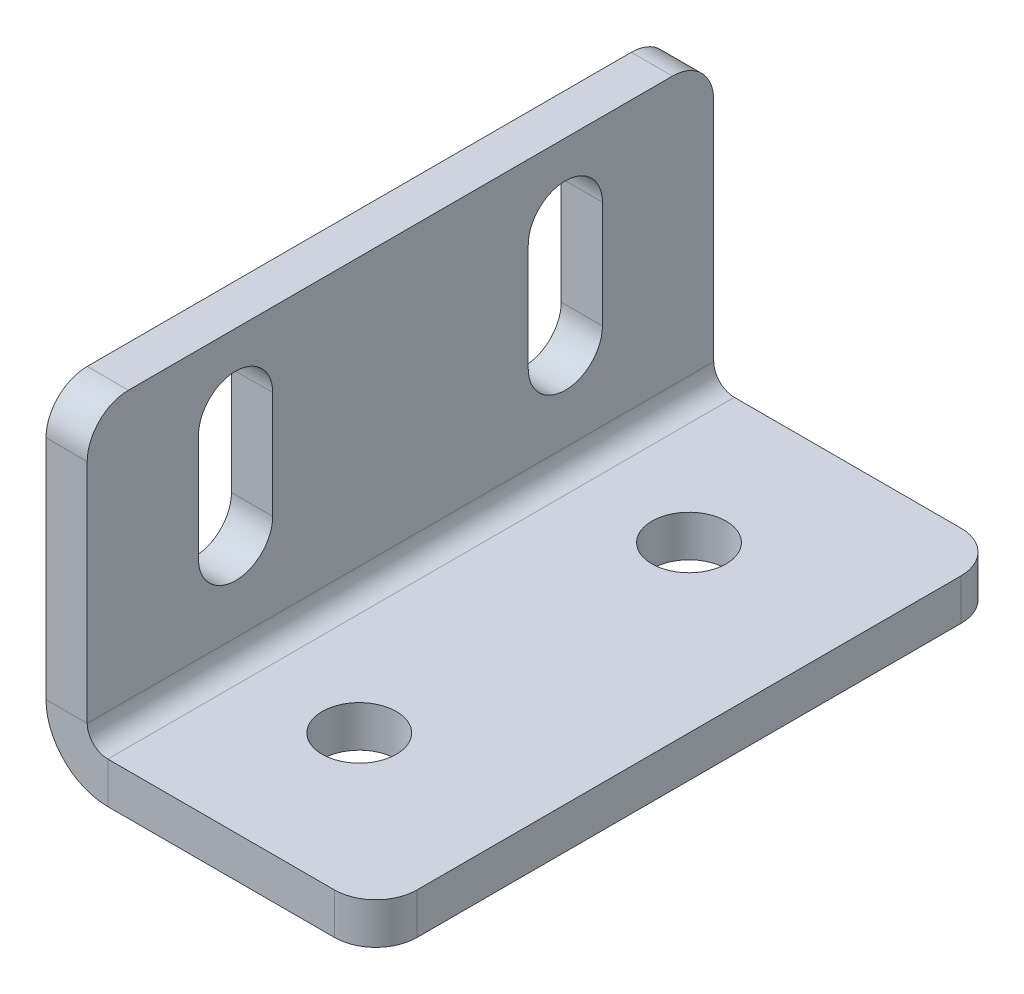
ISO-10303-21;
HEADER;
FILE_DESCRIPTION(('STEP AP214'),'2;1');
FILE_NAME('part.step','',(''),(''),'','','');
FILE_SCHEMA(('AUTOMOTIVE_DESIGN { 1 0 10303 214 1 1 1 1 }'));
ENDSEC;
DATA;
#1=APPLICATION_CONTEXT('core data for automotive mechanical design processes');
#2=APPLICATION_PROTOCOL_DEFINITION('international standard','automotive_design',2000,#1);
#3=PRODUCT_CONTEXT('',#1,'mechanical');
#4=PRODUCT('Part','Part','',(#3));
#5=PRODUCT_RELATED_PRODUCT_CATEGORY('part','',(#4));
#6=PRODUCT_DEFINITION_FORMATION('','',#4);
#7=PRODUCT_DEFINITION_CONTEXT('part definition',#1,'design');
#8=PRODUCT_DEFINITION('design','',#6,#7);
#9=PRODUCT_DEFINITION_SHAPE('','',#8);
#10=(LENGTH_UNIT() NAMED_UNIT(*) SI_UNIT(.MILLI.,.METRE.));
#11=(NAMED_UNIT(*) PLANE_ANGLE_UNIT() SI_UNIT($,.RADIAN.));
#12=(NAMED_UNIT(*) SI_UNIT($,.STERADIAN.) SOLID_ANGLE_UNIT());
#13=UNCERTAINTY_MEASURE_WITH_UNIT(LENGTH_MEASURE(1.E-05),#10,'distance_accuracy_value','');
#14=(GEOMETRIC_REPRESENTATION_CONTEXT(3) GLOBAL_UNCERTAINTY_ASSIGNED_CONTEXT((#13)) GLOBAL_UNIT_ASSIGNED_CONTEXT((#10,
#11,#12)) REPRESENTATION_CONTEXT('',''));
#15=CARTESIAN_POINT('',(0.,0.,0.));
#16=DIRECTION('',(0.,0.,1.));
#17=DIRECTION('',(1.,0.,0.));
#18=AXIS2_PLACEMENT_3D('',#15,#16,#17);
#19=CARTESIAN_POINT('',(0.,18.,-20.));
#20=DIRECTION('',(-1.,0.,0.));
#21=DIRECTION('',(0.,0.,1.));
#22=AXIS2_PLACEMENT_3D('',#19,#20,#21);
#23=CYLINDRICAL_SURFACE('',#22,4.5);
#24=CARTESIAN_POINT('',(5.,18.,-20.));
#25=DIRECTION('',(1.,0.,0.));
#26=DIRECTION('',(0.,0.,-1.));
#27=AXIS2_PLACEMENT_3D('',#24,#25,#26);
#28=CIRCLE('',#27,4.5);
#29=CARTESIAN_POINT('',(5.,18.,-15.5));
#30=VERTEX_POINT('',#29);
#31=CARTESIAN_POINT('',(5.,18.,-24.5));
#32=VERTEX_POINT('',#31);
#33=EDGE_CURVE('E351',#30,#32,#28,.T.);
#34=ORIENTED_EDGE('',*,*,#33,.T.);
#35=DIRECTION('',(1.,0.,0.));
#36=VECTOR('',#35,1.);
#37=CARTESIAN_POINT('',(0.,18.,-24.5));
#38=LINE('',#37,#36);
#39=CARTESIAN_POINT('',(0.,18.,-24.5));
#40=VERTEX_POINT('',#39);
#41=EDGE_CURVE('E255',#40,#32,#38,.T.);
#42=ORIENTED_EDGE('',*,*,#41,.F.);
#43=CARTESIAN_POINT('',(0.,18.,-20.));
#44=DIRECTION('',(1.,0.,0.));
#45=DIRECTION('',(0.,0.,-1.));
#46=AXIS2_PLACEMENT_3D('',#43,#44,#45);
#47=CIRCLE('',#46,4.5);
#48=CARTESIAN_POINT('',(0.,18.,-15.5));
#49=VERTEX_POINT('',#48);
#50=EDGE_CURVE('E264',#49,#40,#47,.T.);
#51=ORIENTED_EDGE('',*,*,#50,.F.);
#52=DIRECTION('',(1.,0.,0.));
#53=VECTOR('',#52,1.);
#54=CARTESIAN_POINT('',(0.,18.,-15.5));
#55=LINE('',#54,#53);
#56=EDGE_CURVE('E258',#49,#30,#55,.T.);
#57=ORIENTED_EDGE('',*,*,#56,.T.);
#58=EDGE_LOOP('',(#34,#42,#51,#57));
#59=FACE_BOUND('',#58,.T.);
#60=ADVANCED_FACE('F46',(#59),#23,.F.);
#61=CARTESIAN_POINT('',(0.,18.,20.));
#62=DIRECTION('',(-1.,0.,0.));
#63=DIRECTION('',(0.,0.,1.));
#64=AXIS2_PLACEMENT_3D('',#61,#62,#63);
#65=CYLINDRICAL_SURFACE('',#64,4.5);
#66=CARTESIAN_POINT('',(5.,18.,20.));
#67=DIRECTION('',(1.,0.,0.));
#68=DIRECTION('',(0.,0.,-1.));
#69=AXIS2_PLACEMENT_3D('',#66,#67,#68);
#70=CIRCLE('',#69,4.5);
#71=CARTESIAN_POINT('',(5.,18.,24.5));
#72=VERTEX_POINT('',#71);
#73=CARTESIAN_POINT('',(5.,18.,15.5));
#74=VERTEX_POINT('',#73);
#75=EDGE_CURVE('E361',#72,#74,#70,.T.);
#76=ORIENTED_EDGE('',*,*,#75,.T.);
#77=DIRECTION('',(1.,0.,0.));
#78=VECTOR('',#77,1.);
#79=CARTESIAN_POINT('',(0.,18.,15.5));
#80=LINE('',#79,#78);
#81=CARTESIAN_POINT('',(0.,18.,15.5));
#82=VERTEX_POINT('',#81);
#83=EDGE_CURVE('E226',#82,#74,#80,.T.);
#84=ORIENTED_EDGE('',*,*,#83,.F.);
#85=CARTESIAN_POINT('',(0.,18.,20.));
#86=DIRECTION('',(1.,0.,0.));
#87=DIRECTION('',(0.,0.,-1.));
#88=AXIS2_PLACEMENT_3D('',#85,#86,#87);
#89=CIRCLE('',#88,4.5);
#90=CARTESIAN_POINT('',(0.,18.,24.5));
#91=VERTEX_POINT('',#90);
#92=EDGE_CURVE('E268',#91,#82,#89,.T.);
#93=ORIENTED_EDGE('',*,*,#92,.F.);
#94=DIRECTION('',(1.,0.,0.));
#95=VECTOR('',#94,1.);
#96=CARTESIAN_POINT('',(0.,18.,24.5));
#97=LINE('',#96,#95);
#98=EDGE_CURVE('E191',#91,#72,#97,.T.);
#99=ORIENTED_EDGE('',*,*,#98,.T.);
#100=EDGE_LOOP('',(#76,#84,#93,#99));
#101=FACE_BOUND('',#100,.T.);
#102=ADVANCED_FACE('F507',(#101),#65,.F.);
#103=CARTESIAN_POINT('',(0.,0.,38.));
#104=DIRECTION('',(0.,0.,-1.));
#105=DIRECTION('',(0.,-1.,0.));
#106=AXIS2_PLACEMENT_3D('',#103,#104,#105);
#107=PLANE('',#106);
#108=DIRECTION('',(0.,1.,0.));
#109=VECTOR('',#108,1.);
#110=CARTESIAN_POINT('',(5.,0.,38.));
#111=LINE('',#110,#109);
#112=CARTESIAN_POINT('',(5.,35.,38.));
#113=VERTEX_POINT('',#112);
#114=CARTESIAN_POINT('',(5.,7.5,38.));
#115=VERTEX_POINT('',#114);
#116=EDGE_CURVE('E358',#113,#115,#111,.F.);
#117=ORIENTED_EDGE('',*,*,#116,.F.);
#118=DIRECTION('',(1.,0.,0.));
#119=VECTOR('',#118,1.);
#120=CARTESIAN_POINT('',(0.,35.,38.));
#121=LINE('',#120,#119);
#122=CARTESIAN_POINT('',(0.,35.,38.));
#123=VERTEX_POINT('',#122);
#124=EDGE_CURVE('E11',#113,#123,#121,.F.);
#125=ORIENTED_EDGE('',*,*,#124,.T.);
#126=DIRECTION('',(0.,-1.,0.));
#127=VECTOR('',#126,1.);
#128=CARTESIAN_POINT('',(0.,0.,38.));
#129=LINE('',#128,#127);
#130=CARTESIAN_POINT('',(0.,7.5,38.));
#131=VERTEX_POINT('',#130);
#132=EDGE_CURVE('E272',#123,#131,#129,.T.);
#133=ORIENTED_EDGE('',*,*,#132,.T.);
#134=DIRECTION('',(-1.,0.,0.));
#135=VECTOR('',#134,1.);
#136=CARTESIAN_POINT('',(0.,7.5,38.));
#137=LINE('',#136,#135);
#138=EDGE_CURVE('E378',#115,#131,#137,.T.);
#139=ORIENTED_EDGE('',*,*,#138,.F.);
#140=EDGE_LOOP('',(#117,#125,#133,#139));
#141=FACE_BOUND('',#140,.T.);
#142=ADVANCED_FACE('F464',(#141),#107,.F.);
#143=CARTESIAN_POINT('',(0.,40.,-38.));
#144=DIRECTION('',(0.,-1.,0.));
#145=DIRECTION('',(0.,0.,1.));
#146=AXIS2_PLACEMENT_3D('',#143,#144,#145);
#147=PLANE('',#146);
#148=DIRECTION('',(0.,0.,1.));
#149=VECTOR('',#148,1.);
#150=CARTESIAN_POINT('',(5.,40.,-38.));
#151=LINE('',#150,#149);
#152=CARTESIAN_POINT('',(5.,40.,-33.));
#153=VERTEX_POINT('',#152);
#154=CARTESIAN_POINT('',(5.,40.,33.));
#155=VERTEX_POINT('',#154);
#156=EDGE_CURVE('E354',#153,#155,#151,.T.);
#157=ORIENTED_EDGE('',*,*,#156,.F.);
#158=DIRECTION('',(-1.,0.,0.));
#159=VECTOR('',#158,1.);
#160=CARTESIAN_POINT('',(0.,40.,-33.));
#161=LINE('',#160,#159);
#162=CARTESIAN_POINT('',(0.,40.,-33.));
#163=VERTEX_POINT('',#162);
#164=EDGE_CURVE('E413',#153,#163,#161,.T.);
#165=ORIENTED_EDGE('',*,*,#164,.T.);
#166=DIRECTION('',(0.,0.,1.));
#167=VECTOR('',#166,1.);
#168=CARTESIAN_POINT('',(0.,40.,-38.));
#169=LINE('',#168,#167);
#170=CARTESIAN_POINT('',(0.,40.,33.));
#171=VERTEX_POINT('',#170);
#172=EDGE_CURVE('E275',#163,#171,#169,.T.);
#173=ORIENTED_EDGE('',*,*,#172,.T.);
#174=DIRECTION('',(1.,0.,0.));
#175=VECTOR('',#174,1.);
#176=CARTESIAN_POINT('',(0.,40.,33.));
#177=LINE('',#176,#175);
#178=EDGE_CURVE('E410',#171,#155,#177,.T.);
#179=ORIENTED_EDGE('',*,*,#178,.T.);
#180=EDGE_LOOP('',(#157,#165,#173,#179));
#181=FACE_BOUND('',#180,.T.);
#182=ADVANCED_FACE('F442',(#181),#147,.F.);
#183=CARTESIAN_POINT('',(0.,0.,-38.));
#184=DIRECTION('',(0.,0.,-1.));
#185=DIRECTION('',(0.,-1.,0.));
#186=AXIS2_PLACEMENT_3D('',#183,#184,#185);
#187=PLANE('',#186);
#188=DIRECTION('',(0.,-1.,0.));
#189=VECTOR('',#188,1.);
#190=CARTESIAN_POINT('',(0.,0.,-38.));
#191=LINE('',#190,#189);
#192=CARTESIAN_POINT('',(0.,35.,-38.));
#193=VERTEX_POINT('',#192);
#194=CARTESIAN_POINT('',(0.,7.5,-38.));
#195=VERTEX_POINT('',#194);
#196=EDGE_CURVE('E279',#193,#195,#191,.T.);
#197=ORIENTED_EDGE('',*,*,#196,.F.);
#198=DIRECTION('',(1.,0.,0.));
#199=VECTOR('',#198,1.);
#200=CARTESIAN_POINT('',(0.,35.,-38.));
#201=LINE('',#200,#199);
#202=CARTESIAN_POINT('',(5.,35.,-38.));
#203=VERTEX_POINT('',#202);
#204=EDGE_CURVE('E423',#193,#203,#201,.T.);
#205=ORIENTED_EDGE('',*,*,#204,.T.);
#206=DIRECTION('',(0.,1.,0.));
#207=VECTOR('',#206,1.);
#208=CARTESIAN_POINT('',(5.,0.,-38.));
#209=LINE('',#208,#207);
#210=CARTESIAN_POINT('',(5.,7.5,-38.));
#211=VERTEX_POINT('',#210);
#212=EDGE_CURVE('E332',#203,#211,#209,.F.);
#213=ORIENTED_EDGE('',*,*,#212,.T.);
#214=DIRECTION('',(-1.,0.,0.));
#215=VECTOR('',#214,1.);
#216=CARTESIAN_POINT('',(0.,7.5,-38.));
#217=LINE('',#216,#215);
#218=EDGE_CURVE('E374',#211,#195,#217,.T.);
#219=ORIENTED_EDGE('',*,*,#218,.T.);
#220=EDGE_LOOP('',(#197,#205,#213,#219));
#221=FACE_BOUND('',#220,.T.);
#222=ADVANCED_FACE('F449',(#221),#187,.T.);
#223=CARTESIAN_POINT('',(7.5,7.5,-38.));
#224=DIRECTION('',(0.,0.,1.));
#225=DIRECTION('',(1.,0.,0.));
#226=AXIS2_PLACEMENT_3D('',#223,#224,#225);
#227=PLANE('',#226);
#228=ORIENTED_EDGE('',*,*,#218,.F.);
#229=CARTESIAN_POINT('',(7.5,7.5,-38.));
#230=DIRECTION('',(0.,0.,1.));
#231=DIRECTION('',(1.,0.,0.));
#232=AXIS2_PLACEMENT_3D('',#229,#230,#231);
#233=CIRCLE('',#232,2.5);
#234=CARTESIAN_POINT('',(7.5,5.,-38.));
#235=VERTEX_POINT('',#234);
#236=EDGE_CURVE('E347',#211,#235,#233,.T.);
#237=ORIENTED_EDGE('',*,*,#236,.T.);
#238=DIRECTION('',(0.,-1.,0.));
#239=VECTOR('',#238,1.);
#240=CARTESIAN_POINT('',(7.5,0.,-38.));
#241=LINE('',#240,#239);
#242=CARTESIAN_POINT('',(7.5,0.,-38.));
#243=VERTEX_POINT('',#242);
#244=EDGE_CURVE('E371',#235,#243,#241,.T.);
#245=ORIENTED_EDGE('',*,*,#244,.T.);
#246=CARTESIAN_POINT('',(7.5,7.5,-38.));
#247=DIRECTION('',(0.,0.,-1.));
#248=DIRECTION('',(-1.,0.,0.));
#249=AXIS2_PLACEMENT_3D('',#246,#247,#248);
#250=CIRCLE('',#249,7.5);
#251=EDGE_CURVE('E269',#195,#243,#250,.F.);
#252=ORIENTED_EDGE('',*,*,#251,.F.);
#253=EDGE_LOOP('',(#228,#237,#245,#252));
#254=FACE_BOUND('',#253,.T.);
#255=ADVANCED_FACE('F454',(#254),#227,.F.);
#256=CARTESIAN_POINT('',(40.,0.,-38.));
#257=DIRECTION('',(0.,0.,-1.));
#258=DIRECTION('',(1.,0.,0.));
#259=AXIS2_PLACEMENT_3D('',#256,#257,#258);
#260=PLANE('',#259);
#261=DIRECTION('',(1.,0.,0.));
#262=VECTOR('',#261,1.);
#263=CARTESIAN_POINT('',(40.,5.,-38.));
#264=LINE('',#263,#262);
#265=CARTESIAN_POINT('',(35.,5.,-38.));
#266=VERTEX_POINT('',#265);
#267=EDGE_CURVE('E326',#235,#266,#264,.T.);
#268=ORIENTED_EDGE('',*,*,#267,.T.);
#269=DIRECTION('',(0.,-1.,0.));
#270=VECTOR('',#269,1.);
#271=CARTESIAN_POINT('',(35.,0.,-38.));
#272=LINE('',#271,#270);
#273=CARTESIAN_POINT('',(35.,0.,-38.));
#274=VERTEX_POINT('',#273);
#275=EDGE_CURVE('E382',#266,#274,#272,.T.);
#276=ORIENTED_EDGE('',*,*,#275,.T.);
#277=DIRECTION('',(1.,0.,0.));
#278=VECTOR('',#277,1.);
#279=CARTESIAN_POINT('',(40.,0.,-38.));
#280=LINE('',#279,#278);
#281=EDGE_CURVE('E298',#243,#274,#280,.T.);
#282=ORIENTED_EDGE('',*,*,#281,.F.);
#283=ORIENTED_EDGE('',*,*,#244,.F.);
#284=EDGE_LOOP('',(#268,#276,#282,#283));
#285=FACE_BOUND('',#284,.T.);
#286=ADVANCED_FACE('F497',(#285),#260,.T.);
#287=CARTESIAN_POINT('',(40.,0.,-38.));
#288=DIRECTION('',(1.,0.,0.));
#289=DIRECTION('',(0.,0.,1.));
#290=AXIS2_PLACEMENT_3D('',#287,#288,#289);
#291=PLANE('',#290);
#292=DIRECTION('',(0.,0.,1.));
#293=VECTOR('',#292,1.);
#294=CARTESIAN_POINT('',(40.,0.,-38.));
#295=LINE('',#294,#293);
#296=CARTESIAN_POINT('',(40.,0.,-33.));
#297=VERTEX_POINT('',#296);
#298=CARTESIAN_POINT('',(40.,0.,33.));
#299=VERTEX_POINT('',#298);
#300=EDGE_CURVE('E290',#297,#299,#295,.T.);
#301=ORIENTED_EDGE('',*,*,#300,.F.);
#302=DIRECTION('',(0.,-1.,0.));
#303=VECTOR('',#302,1.);
#304=CARTESIAN_POINT('',(40.,0.,-33.));
#305=LINE('',#304,#303);
#306=CARTESIAN_POINT('',(40.,5.,-33.));
#307=VERTEX_POINT('',#306);
#308=EDGE_CURVE('E398',#297,#307,#305,.F.);
#309=ORIENTED_EDGE('',*,*,#308,.T.);
#310=DIRECTION('',(0.,0.,1.));
#311=VECTOR('',#310,1.);
#312=CARTESIAN_POINT('',(40.,5.,-38.));
#313=LINE('',#312,#311);
#314=CARTESIAN_POINT('',(40.,5.,33.));
#315=VERTEX_POINT('',#314);
#316=EDGE_CURVE('E336',#307,#315,#313,.T.);
#317=ORIENTED_EDGE('',*,*,#316,.T.);
#318=DIRECTION('',(0.,1.,0.));
#319=VECTOR('',#318,1.);
#320=CARTESIAN_POINT('',(40.,0.,33.));
#321=LINE('',#320,#319);
#322=EDGE_CURVE('E394',#315,#299,#321,.F.);
#323=ORIENTED_EDGE('',*,*,#322,.T.);
#324=EDGE_LOOP('',(#301,#309,#317,#323));
#325=FACE_BOUND('',#324,.T.);
#326=ADVANCED_FACE('F488',(#325),#291,.T.);
#327=CARTESIAN_POINT('',(40.,0.,38.));
#328=DIRECTION('',(0.,0.,-1.));
#329=DIRECTION('',(1.,0.,0.));
#330=AXIS2_PLACEMENT_3D('',#327,#328,#329);
#331=PLANE('',#330);
#332=DIRECTION('',(1.,0.,0.));
#333=VECTOR('',#332,1.);
#334=CARTESIAN_POINT('',(40.,0.,38.));
#335=LINE('',#334,#333);
#336=CARTESIAN_POINT('',(7.5,0.,38.));
#337=VERTEX_POINT('',#336);
#338=CARTESIAN_POINT('',(35.,0.,38.));
#339=VERTEX_POINT('',#338);
#340=EDGE_CURVE('E294',#337,#339,#335,.T.);
#341=ORIENTED_EDGE('',*,*,#340,.T.);
#342=DIRECTION('',(0.,-1.,0.));
#343=VECTOR('',#342,1.);
#344=CARTESIAN_POINT('',(35.,0.,38.));
#345=LINE('',#344,#343);
#346=CARTESIAN_POINT('',(35.,5.,38.));
#347=VERTEX_POINT('',#346);
#348=EDGE_CURVE('E407',#339,#347,#345,.F.);
#349=ORIENTED_EDGE('',*,*,#348,.T.);
#350=DIRECTION('',(1.,0.,0.));
#351=VECTOR('',#350,1.);
#352=CARTESIAN_POINT('',(40.,5.,38.));
#353=LINE('',#352,#351);
#354=CARTESIAN_POINT('',(7.5,5.,38.));
#355=VERTEX_POINT('',#354);
#356=EDGE_CURVE('E337',#355,#347,#353,.T.);
#357=ORIENTED_EDGE('',*,*,#356,.F.);
#358=DIRECTION('',(0.,-1.,0.));
#359=VECTOR('',#358,1.);
#360=CARTESIAN_POINT('',(7.5,0.,38.));
#361=LINE('',#360,#359);
#362=EDGE_CURVE('E310',#355,#337,#361,.T.);
#363=ORIENTED_EDGE('',*,*,#362,.T.);
#364=EDGE_LOOP('',(#341,#349,#357,#363));
#365=FACE_BOUND('',#364,.T.);
#366=ADVANCED_FACE('F475',(#365),#331,.F.);
#367=CARTESIAN_POINT('',(20.,0.,-20.));
#368=DIRECTION('',(0.,-1.,0.));
#369=DIRECTION('',(1.,0.,0.));
#370=AXIS2_PLACEMENT_3D('',#367,#368,#369);
#371=CYLINDRICAL_SURFACE('',#370,4.5);
#372=CARTESIAN_POINT('',(20.,0.,-20.));
#373=DIRECTION('',(0.,-1.,0.));
#374=DIRECTION('',(0.,0.,-1.));
#375=AXIS2_PLACEMENT_3D('',#372,#373,#374);
#376=CIRCLE('',#375,4.5);
#377=CARTESIAN_POINT('',(20.,0.,-24.5));
#378=VERTEX_POINT('',#377);
#379=EDGE_CURVE('E282',#378,#378,#376,.T.);
#380=ORIENTED_EDGE('',*,*,#379,.T.);
#381=EDGE_LOOP('',(#380));
#382=FACE_BOUND('',#381,.T.);
#383=CARTESIAN_POINT('',(20.,5.,-20.));
#384=DIRECTION('',(0.,-1.,0.));
#385=DIRECTION('',(0.,0.,-1.));
#386=AXIS2_PLACEMENT_3D('',#383,#384,#385);
#387=CIRCLE('',#386,4.5);
#388=CARTESIAN_POINT('',(20.,5.,-24.5));
#389=VERTEX_POINT('',#388);
#390=EDGE_CURVE('E327',#389,#389,#387,.T.);
#391=ORIENTED_EDGE('',*,*,#390,.F.);
#392=EDGE_LOOP('',(#391));
#393=FACE_BOUND('',#392,.T.);
#394=ADVANCED_FACE('F555',(#382,#393),#371,.F.);
#395=CARTESIAN_POINT('',(20.,0.,20.));
#396=DIRECTION('',(0.,-1.,0.));
#397=DIRECTION('',(1.,0.,0.));
#398=AXIS2_PLACEMENT_3D('',#395,#396,#397);
#399=CYLINDRICAL_SURFACE('',#398,4.5);
#400=CARTESIAN_POINT('',(20.,0.,20.));
#401=DIRECTION('',(0.,-1.,0.));
#402=DIRECTION('',(0.,0.,-1.));
#403=AXIS2_PLACEMENT_3D('',#400,#401,#402);
#404=CIRCLE('',#403,4.5);
#405=CARTESIAN_POINT('',(20.,0.,15.5));
#406=VERTEX_POINT('',#405);
#407=EDGE_CURVE('E286',#406,#406,#404,.T.);
#408=ORIENTED_EDGE('',*,*,#407,.T.);
#409=EDGE_LOOP('',(#408));
#410=FACE_BOUND('',#409,.T.);
#411=CARTESIAN_POINT('',(20.,5.,20.));
#412=DIRECTION('',(0.,-1.,0.));
#413=DIRECTION('',(0.,0.,-1.));
#414=AXIS2_PLACEMENT_3D('',#411,#412,#413);
#415=CIRCLE('',#414,4.5);
#416=CARTESIAN_POINT('',(20.,5.,15.5));
#417=VERTEX_POINT('',#416);
#418=EDGE_CURVE('E331',#417,#417,#415,.T.);
#419=ORIENTED_EDGE('',*,*,#418,.F.);
#420=EDGE_LOOP('',(#419));
#421=FACE_BOUND('',#420,.T.);
#422=ADVANCED_FACE('F558',(#410,#421),#399,.F.);
#423=CARTESIAN_POINT('',(7.5,7.5,38.));
#424=DIRECTION('',(0.,0.,-1.));
#425=DIRECTION('',(-1.,0.,0.));
#426=AXIS2_PLACEMENT_3D('',#423,#424,#425);
#427=PLANE('',#426);
#428=CARTESIAN_POINT('',(7.5,7.5,38.));
#429=DIRECTION('',(0.,0.,1.));
#430=DIRECTION('',(1.,0.,0.));
#431=AXIS2_PLACEMENT_3D('',#428,#429,#430);
#432=CIRCLE('',#431,2.5);
#433=EDGE_CURVE('E225',#355,#115,#432,.F.);
#434=ORIENTED_EDGE('',*,*,#433,.T.);
#435=ORIENTED_EDGE('',*,*,#138,.T.);
#436=CARTESIAN_POINT('',(7.5,7.5,38.));
#437=DIRECTION('',(0.,0.,1.));
#438=DIRECTION('',(1.,0.,0.));
#439=AXIS2_PLACEMENT_3D('',#436,#437,#438);
#440=CIRCLE('',#439,7.5);
#441=EDGE_CURVE('E311',#337,#131,#440,.F.);
#442=ORIENTED_EDGE('',*,*,#441,.F.);
#443=ORIENTED_EDGE('',*,*,#362,.F.);
#444=EDGE_LOOP('',(#434,#435,#442,#443));
#445=FACE_BOUND('',#444,.T.);
#446=ADVANCED_FACE('F467',(#445),#427,.F.);
#447=CARTESIAN_POINT('',(40.,0.,-38.));
#448=DIRECTION('',(0.,-1.,0.));
#449=DIRECTION('',(1.,0.,0.));
#450=AXIS2_PLACEMENT_3D('',#447,#448,#449);
#451=PLANE('',#450);
#452=ORIENTED_EDGE('',*,*,#379,.F.);
#453=EDGE_LOOP('',(#452));
#454=FACE_BOUND('',#453,.T.);
#455=ORIENTED_EDGE('',*,*,#407,.F.);
#456=EDGE_LOOP('',(#455));
#457=FACE_BOUND('',#456,.T.);
#458=ORIENTED_EDGE('',*,*,#281,.T.);
#459=CARTESIAN_POINT('',(35.,0.,-33.));
#460=DIRECTION('',(0.,-1.,0.));
#461=DIRECTION('',(1.,0.,0.));
#462=AXIS2_PLACEMENT_3D('',#459,#460,#461);
#463=CIRCLE('',#462,5.);
#464=EDGE_CURVE('E391',#274,#297,#463,.T.);
#465=ORIENTED_EDGE('',*,*,#464,.T.);
#466=ORIENTED_EDGE('',*,*,#300,.T.);
#467=CARTESIAN_POINT('',(35.,0.,33.));
#468=DIRECTION('',(0.,-1.,0.));
#469=DIRECTION('',(1.,0.,0.));
#470=AXIS2_PLACEMENT_3D('',#467,#468,#469);
#471=CIRCLE('',#470,5.);
#472=EDGE_CURVE('E388',#299,#339,#471,.T.);
#473=ORIENTED_EDGE('',*,*,#472,.T.);
#474=ORIENTED_EDGE('',*,*,#340,.F.);
#475=DIRECTION('',(0.,0.,1.));
#476=VECTOR('',#475,1.);
#477=CARTESIAN_POINT('',(7.5,0.,-38.));
#478=LINE('',#477,#476);
#479=EDGE_CURVE('E306',#337,#243,#478,.F.);
#480=ORIENTED_EDGE('',*,*,#479,.T.);
#481=EDGE_LOOP('',(#458,#465,#466,#473,#474,#480));
#482=FACE_BOUND('',#481,.T.);
#483=ADVANCED_FACE('F491',(#454,#457,#482),#451,.T.);
#484=CARTESIAN_POINT('',(0.,0.,-38.));
#485=DIRECTION('',(-1.,0.,0.));
#486=DIRECTION('',(0.,0.,1.));
#487=AXIS2_PLACEMENT_3D('',#484,#485,#486);
#488=PLANE('',#487);
#489=DIRECTION('',(0.,1.,0.));
#490=VECTOR('',#489,1.);
#491=CARTESIAN_POINT('',(0.,31.,15.5));
#492=LINE('',#491,#490);
#493=CARTESIAN_POINT('',(0.,31.,15.5));
#494=VERTEX_POINT('',#493);
#495=EDGE_CURVE('E192',#82,#494,#492,.T.);
#496=ORIENTED_EDGE('',*,*,#495,.T.);
#497=CARTESIAN_POINT('',(0.,31.,20.));
#498=DIRECTION('',(1.,0.,0.));
#499=DIRECTION('',(0.,0.,-1.));
#500=AXIS2_PLACEMENT_3D('',#497,#498,#499);
#501=CIRCLE('',#500,4.5);
#502=CARTESIAN_POINT('',(0.,31.,24.5));
#503=VERTEX_POINT('',#502);
#504=EDGE_CURVE('E186',#494,#503,#501,.T.);
#505=ORIENTED_EDGE('',*,*,#504,.T.);
#506=DIRECTION('',(0.,-1.,0.));
#507=VECTOR('',#506,1.);
#508=CARTESIAN_POINT('',(0.,31.,24.5));
#509=LINE('',#508,#507);
#510=EDGE_CURVE('E195',#503,#91,#509,.T.);
#511=ORIENTED_EDGE('',*,*,#510,.T.);
#512=ORIENTED_EDGE('',*,*,#92,.T.);
#513=EDGE_LOOP('',(#496,#505,#511,#512));
#514=FACE_BOUND('',#513,.T.);
#515=DIRECTION('',(0.,1.,0.));
#516=VECTOR('',#515,1.);
#517=CARTESIAN_POINT('',(0.,31.,-24.5));
#518=LINE('',#517,#516);
#519=CARTESIAN_POINT('',(0.,31.,-24.5));
#520=VERTEX_POINT('',#519);
#521=EDGE_CURVE('E240',#40,#520,#518,.T.);
#522=ORIENTED_EDGE('',*,*,#521,.T.);
#523=CARTESIAN_POINT('',(0.,31.,-20.));
#524=DIRECTION('',(1.,0.,0.));
#525=DIRECTION('',(0.,0.,-1.));
#526=AXIS2_PLACEMENT_3D('',#523,#524,#525);
#527=CIRCLE('',#526,4.5);
#528=CARTESIAN_POINT('',(0.,31.,-15.5));
#529=VERTEX_POINT('',#528);
#530=EDGE_CURVE('E231',#520,#529,#527,.T.);
#531=ORIENTED_EDGE('',*,*,#530,.T.);
#532=DIRECTION('',(0.,-1.,0.));
#533=VECTOR('',#532,1.);
#534=CARTESIAN_POINT('',(0.,31.,-15.5));
#535=LINE('',#534,#533);
#536=EDGE_CURVE('E235',#529,#49,#535,.T.);
#537=ORIENTED_EDGE('',*,*,#536,.T.);
#538=ORIENTED_EDGE('',*,*,#50,.T.);
#539=EDGE_LOOP('',(#522,#531,#537,#538));
#540=FACE_BOUND('',#539,.T.);
#541=ORIENTED_EDGE('',*,*,#172,.F.);
#542=CARTESIAN_POINT('',(0.,35.,-33.));
#543=DIRECTION('',(-1.,0.,0.));
#544=DIRECTION('',(0.,0.,1.));
#545=AXIS2_PLACEMENT_3D('',#542,#543,#544);
#546=CIRCLE('',#545,5.);
#547=EDGE_CURVE('E420',#163,#193,#546,.T.);
#548=ORIENTED_EDGE('',*,*,#547,.T.);
#549=ORIENTED_EDGE('',*,*,#196,.T.);
#550=DIRECTION('',(0.,0.,1.));
#551=VECTOR('',#550,1.);
#552=CARTESIAN_POINT('',(0.,7.5,-38.));
#553=LINE('',#552,#551);
#554=EDGE_CURVE('E302',#195,#131,#553,.T.);
#555=ORIENTED_EDGE('',*,*,#554,.T.);
#556=ORIENTED_EDGE('',*,*,#132,.F.);
#557=CARTESIAN_POINT('',(0.,35.,33.));
#558=DIRECTION('',(-1.,0.,0.));
#559=DIRECTION('',(0.,0.,1.));
#560=AXIS2_PLACEMENT_3D('',#557,#558,#559);
#561=CIRCLE('',#560,5.);
#562=EDGE_CURVE('E417',#123,#171,#561,.T.);
#563=ORIENTED_EDGE('',*,*,#562,.T.);
#564=EDGE_LOOP('',(#541,#548,#549,#555,#556,#563));
#565=FACE_BOUND('',#564,.T.);
#566=ADVANCED_FACE('F203',(#514,#540,#565),#488,.T.);
#567=CARTESIAN_POINT('',(7.5,7.5,-38.));
#568=DIRECTION('',(0.,0.,1.));
#569=DIRECTION('',(1.,0.,0.));
#570=AXIS2_PLACEMENT_3D('',#567,#568,#569);
#571=CYLINDRICAL_SURFACE('',#570,7.5);
#572=ORIENTED_EDGE('',*,*,#251,.T.);
#573=ORIENTED_EDGE('',*,*,#479,.F.);
#574=ORIENTED_EDGE('',*,*,#441,.T.);
#575=ORIENTED_EDGE('',*,*,#554,.F.);
#576=EDGE_LOOP('',(#572,#573,#574,#575));
#577=FACE_BOUND('',#576,.T.);
#578=ADVANCED_FACE('F458',(#577),#571,.T.);
#579=CARTESIAN_POINT('',(40.,5.,-38.));
#580=DIRECTION('',(0.,-1.,0.));
#581=DIRECTION('',(1.,0.,0.));
#582=AXIS2_PLACEMENT_3D('',#579,#580,#581);
#583=PLANE('',#582);
#584=ORIENTED_EDGE('',*,*,#390,.T.);
#585=EDGE_LOOP('',(#584));
#586=FACE_BOUND('',#585,.T.);
#587=ORIENTED_EDGE('',*,*,#418,.T.);
#588=EDGE_LOOP('',(#587));
#589=FACE_BOUND('',#588,.T.);
#590=ORIENTED_EDGE('',*,*,#316,.F.);
#591=CARTESIAN_POINT('',(35.,5.,-33.));
#592=DIRECTION('',(0.,-1.,0.));
#593=DIRECTION('',(1.,0.,0.));
#594=AXIS2_PLACEMENT_3D('',#591,#592,#593);
#595=CIRCLE('',#594,5.);
#596=EDGE_CURVE('E404',#307,#266,#595,.F.);
#597=ORIENTED_EDGE('',*,*,#596,.T.);
#598=ORIENTED_EDGE('',*,*,#267,.F.);
#599=DIRECTION('',(0.,0.,1.));
#600=VECTOR('',#599,1.);
#601=CARTESIAN_POINT('',(7.5,5.,-38.));
#602=LINE('',#601,#600);
#603=EDGE_CURVE('E315',#355,#235,#602,.F.);
#604=ORIENTED_EDGE('',*,*,#603,.F.);
#605=ORIENTED_EDGE('',*,*,#356,.T.);
#606=CARTESIAN_POINT('',(35.,5.,33.));
#607=DIRECTION('',(0.,-1.,0.));
#608=DIRECTION('',(1.,0.,0.));
#609=AXIS2_PLACEMENT_3D('',#606,#607,#608);
#610=CIRCLE('',#609,5.);
#611=EDGE_CURVE('E401',#347,#315,#610,.F.);
#612=ORIENTED_EDGE('',*,*,#611,.T.);
#613=EDGE_LOOP('',(#590,#597,#598,#604,#605,#612));
#614=FACE_BOUND('',#613,.T.);
#615=ADVANCED_FACE('F481',(#586,#589,#614),#583,.F.);
#616=CARTESIAN_POINT('',(5.,0.,-38.));
#617=DIRECTION('',(-1.,0.,0.));
#618=DIRECTION('',(0.,0.,1.));
#619=AXIS2_PLACEMENT_3D('',#616,#617,#618);
#620=PLANE('',#619);
#621=CARTESIAN_POINT('',(5.,31.,-20.));
#622=DIRECTION('',(1.,0.,0.));
#623=DIRECTION('',(0.,0.,-1.));
#624=AXIS2_PLACEMENT_3D('',#621,#622,#623);
#625=CIRCLE('',#624,4.5);
#626=CARTESIAN_POINT('',(5.,31.,-24.5));
#627=VERTEX_POINT('',#626);
#628=CARTESIAN_POINT('',(5.,31.,-15.5));
#629=VERTEX_POINT('',#628);
#630=EDGE_CURVE('E70',#627,#629,#625,.T.);
#631=ORIENTED_EDGE('',*,*,#630,.F.);
#632=DIRECTION('',(0.,1.,0.));
#633=VECTOR('',#632,1.);
#634=CARTESIAN_POINT('',(5.,31.,-24.5));
#635=LINE('',#634,#633);
#636=EDGE_CURVE('E236',#32,#627,#635,.T.);
#637=ORIENTED_EDGE('',*,*,#636,.F.);
#638=ORIENTED_EDGE('',*,*,#33,.F.);
#639=DIRECTION('',(0.,-1.,0.));
#640=VECTOR('',#639,1.);
#641=CARTESIAN_POINT('',(5.,31.,-15.5));
#642=LINE('',#641,#640);
#643=EDGE_CURVE('E247',#629,#30,#642,.T.);
#644=ORIENTED_EDGE('',*,*,#643,.F.);
#645=EDGE_LOOP('',(#631,#637,#638,#644));
#646=FACE_BOUND('',#645,.T.);
#647=CARTESIAN_POINT('',(5.,31.,20.));
#648=DIRECTION('',(1.,0.,0.));
#649=DIRECTION('',(0.,0.,-1.));
#650=AXIS2_PLACEMENT_3D('',#647,#648,#649);
#651=CIRCLE('',#650,4.5);
#652=CARTESIAN_POINT('',(5.,31.,15.5));
#653=VERTEX_POINT('',#652);
#654=CARTESIAN_POINT('',(5.,31.,24.5));
#655=VERTEX_POINT('',#654);
#656=EDGE_CURVE('E62',#653,#655,#651,.T.);
#657=ORIENTED_EDGE('',*,*,#656,.F.);
#658=DIRECTION('',(0.,1.,0.));
#659=VECTOR('',#658,1.);
#660=CARTESIAN_POINT('',(5.,31.,15.5));
#661=LINE('',#660,#659);
#662=EDGE_CURVE('E206',#74,#653,#661,.T.);
#663=ORIENTED_EDGE('',*,*,#662,.F.);
#664=ORIENTED_EDGE('',*,*,#75,.F.);
#665=DIRECTION('',(0.,-1.,0.));
#666=VECTOR('',#665,1.);
#667=CARTESIAN_POINT('',(5.,31.,24.5));
#668=LINE('',#667,#666);
#669=EDGE_CURVE('E212',#655,#72,#668,.T.);
#670=ORIENTED_EDGE('',*,*,#669,.F.);
#671=EDGE_LOOP('',(#657,#663,#664,#670));
#672=FACE_BOUND('',#671,.T.);
#673=ORIENTED_EDGE('',*,*,#212,.F.);
#674=CARTESIAN_POINT('',(5.,35.,-33.));
#675=DIRECTION('',(-1.,0.,0.));
#676=DIRECTION('',(0.,0.,1.));
#677=AXIS2_PLACEMENT_3D('',#674,#675,#676);
#678=CIRCLE('',#677,5.);
#679=EDGE_CURVE('E55',#203,#153,#678,.F.);
#680=ORIENTED_EDGE('',*,*,#679,.T.);
#681=ORIENTED_EDGE('',*,*,#156,.T.);
#682=CARTESIAN_POINT('',(5.,35.,33.));
#683=DIRECTION('',(-1.,0.,0.));
#684=DIRECTION('',(0.,0.,1.));
#685=AXIS2_PLACEMENT_3D('',#682,#683,#684);
#686=CIRCLE('',#685,5.);
#687=EDGE_CURVE('E426',#155,#113,#686,.F.);
#688=ORIENTED_EDGE('',*,*,#687,.T.);
#689=ORIENTED_EDGE('',*,*,#116,.T.);
#690=DIRECTION('',(0.,0.,1.));
#691=VECTOR('',#690,1.);
#692=CARTESIAN_POINT('',(5.,7.5,-38.));
#693=LINE('',#692,#691);
#694=EDGE_CURVE('E322',#211,#115,#693,.T.);
#695=ORIENTED_EDGE('',*,*,#694,.F.);
#696=EDGE_LOOP('',(#673,#680,#681,#688,#689,#695));
#697=FACE_BOUND('',#696,.T.);
#698=ADVANCED_FACE('F435',(#646,#672,#697),#620,.F.);
#699=CARTESIAN_POINT('',(7.5,7.5,-38.));
#700=DIRECTION('',(0.,0.,1.));
#701=DIRECTION('',(1.,0.,0.));
#702=AXIS2_PLACEMENT_3D('',#699,#700,#701);
#703=CYLINDRICAL_SURFACE('',#702,2.5);
#704=ORIENTED_EDGE('',*,*,#236,.F.);
#705=ORIENTED_EDGE('',*,*,#694,.T.);
#706=ORIENTED_EDGE('',*,*,#433,.F.);
#707=ORIENTED_EDGE('',*,*,#603,.T.);
#708=EDGE_LOOP('',(#704,#705,#706,#707));
#709=FACE_BOUND('',#708,.T.);
#710=ADVANCED_FACE('F473',(#709),#703,.F.);
#711=CARTESIAN_POINT('',(35.,0.,-33.));
#712=DIRECTION('',(0.,-1.,0.));
#713=DIRECTION('',(1.,0.,0.));
#714=AXIS2_PLACEMENT_3D('',#711,#712,#713);
#715=CYLINDRICAL_SURFACE('',#714,5.);
#716=ORIENTED_EDGE('',*,*,#596,.F.);
#717=ORIENTED_EDGE('',*,*,#308,.F.);
#718=ORIENTED_EDGE('',*,*,#464,.F.);
#719=ORIENTED_EDGE('',*,*,#275,.F.);
#720=EDGE_LOOP('',(#716,#717,#718,#719));
#721=FACE_BOUND('',#720,.T.);
#722=ADVANCED_FACE('F495',(#721),#715,.T.);
#723=CARTESIAN_POINT('',(35.,0.,33.));
#724=DIRECTION('',(0.,1.,0.));
#725=DIRECTION('',(-1.,0.,0.));
#726=AXIS2_PLACEMENT_3D('',#723,#724,#725);
#727=CYLINDRICAL_SURFACE('',#726,5.);
#728=ORIENTED_EDGE('',*,*,#611,.F.);
#729=ORIENTED_EDGE('',*,*,#348,.F.);
#730=ORIENTED_EDGE('',*,*,#472,.F.);
#731=ORIENTED_EDGE('',*,*,#322,.F.);
#732=EDGE_LOOP('',(#728,#729,#730,#731));
#733=FACE_BOUND('',#732,.T.);
#734=ADVANCED_FACE('F485',(#733),#727,.T.);
#735=CARTESIAN_POINT('',(0.,35.,-33.));
#736=DIRECTION('',(1.,0.,0.));
#737=DIRECTION('',(0.,0.,-1.));
#738=AXIS2_PLACEMENT_3D('',#735,#736,#737);
#739=CYLINDRICAL_SURFACE('',#738,5.);
#740=ORIENTED_EDGE('',*,*,#679,.F.);
#741=ORIENTED_EDGE('',*,*,#204,.F.);
#742=ORIENTED_EDGE('',*,*,#547,.F.);
#743=ORIENTED_EDGE('',*,*,#164,.F.);
#744=EDGE_LOOP('',(#740,#741,#742,#743));
#745=FACE_BOUND('',#744,.T.);
#746=ADVANCED_FACE('F445',(#745),#739,.T.);
#747=CARTESIAN_POINT('',(0.,35.,33.));
#748=DIRECTION('',(-1.,0.,0.));
#749=DIRECTION('',(0.,0.,1.));
#750=AXIS2_PLACEMENT_3D('',#747,#748,#749);
#751=CYLINDRICAL_SURFACE('',#750,5.);
#752=ORIENTED_EDGE('',*,*,#687,.F.);
#753=ORIENTED_EDGE('',*,*,#178,.F.);
#754=ORIENTED_EDGE('',*,*,#562,.F.);
#755=ORIENTED_EDGE('',*,*,#124,.F.);
#756=EDGE_LOOP('',(#752,#753,#754,#755));
#757=FACE_BOUND('',#756,.T.);
#758=ADVANCED_FACE('F48',(#757),#751,.T.);
#759=CARTESIAN_POINT('',(0.,31.,-20.));
#760=DIRECTION('',(1.,0.,0.));
#761=DIRECTION('',(0.,0.,-1.));
#762=AXIS2_PLACEMENT_3D('',#759,#760,#761);
#763=CYLINDRICAL_SURFACE('',#762,4.5);
#764=ORIENTED_EDGE('',*,*,#630,.T.);
#765=DIRECTION('',(1.,0.,0.));
#766=VECTOR('',#765,1.);
#767=CARTESIAN_POINT('',(0.,31.,-15.5));
#768=LINE('',#767,#766);
#769=EDGE_CURVE('E244',#529,#629,#768,.T.);
#770=ORIENTED_EDGE('',*,*,#769,.F.);
#771=ORIENTED_EDGE('',*,*,#530,.F.);
#772=DIRECTION('',(1.,0.,0.));
#773=VECTOR('',#772,1.);
#774=CARTESIAN_POINT('',(0.,31.,-24.5));
#775=LINE('',#774,#773);
#776=EDGE_CURVE('E219',#520,#627,#775,.T.);
#777=ORIENTED_EDGE('',*,*,#776,.T.);
#778=EDGE_LOOP('',(#764,#770,#771,#777));
#779=FACE_BOUND('',#778,.T.);
#780=ADVANCED_FACE('F525',(#779),#763,.F.);
#781=CARTESIAN_POINT('',(0.,31.,-24.5));
#782=DIRECTION('',(0.,0.,-1.));
#783=DIRECTION('',(-1.,0.,0.));
#784=AXIS2_PLACEMENT_3D('',#781,#782,#783);
#785=PLANE('',#784);
#786=ORIENTED_EDGE('',*,*,#636,.T.);
#787=ORIENTED_EDGE('',*,*,#776,.F.);
#788=ORIENTED_EDGE('',*,*,#521,.F.);
#789=ORIENTED_EDGE('',*,*,#41,.T.);
#790=EDGE_LOOP('',(#786,#787,#788,#789));
#791=FACE_BOUND('',#790,.T.);
#792=ADVANCED_FACE('F530',(#791),#785,.F.);
#793=CARTESIAN_POINT('',(0.,31.,-15.5));
#794=DIRECTION('',(0.,0.,1.));
#795=DIRECTION('',(1.,0.,0.));
#796=AXIS2_PLACEMENT_3D('',#793,#794,#795);
#797=PLANE('',#796);
#798=ORIENTED_EDGE('',*,*,#643,.T.);
#799=ORIENTED_EDGE('',*,*,#56,.F.);
#800=ORIENTED_EDGE('',*,*,#536,.F.);
#801=ORIENTED_EDGE('',*,*,#769,.T.);
#802=EDGE_LOOP('',(#798,#799,#800,#801));
#803=FACE_BOUND('',#802,.T.);
#804=ADVANCED_FACE('F535',(#803),#797,.F.);
#805=CARTESIAN_POINT('',(0.,31.,20.));
#806=DIRECTION('',(1.,0.,0.));
#807=DIRECTION('',(0.,0.,-1.));
#808=AXIS2_PLACEMENT_3D('',#805,#806,#807);
#809=CYLINDRICAL_SURFACE('',#808,4.5);
#810=ORIENTED_EDGE('',*,*,#656,.T.);
#811=DIRECTION('',(1.,0.,0.));
#812=VECTOR('',#811,1.);
#813=CARTESIAN_POINT('',(0.,31.,24.5));
#814=LINE('',#813,#812);
#815=EDGE_CURVE('E182',#503,#655,#814,.T.);
#816=ORIENTED_EDGE('',*,*,#815,.F.);
#817=ORIENTED_EDGE('',*,*,#504,.F.);
#818=DIRECTION('',(1.,0.,0.));
#819=VECTOR('',#818,1.);
#820=CARTESIAN_POINT('',(0.,31.,15.5));
#821=LINE('',#820,#819);
#822=EDGE_CURVE('E222',#494,#653,#821,.T.);
#823=ORIENTED_EDGE('',*,*,#822,.T.);
#824=EDGE_LOOP('',(#810,#816,#817,#823));
#825=FACE_BOUND('',#824,.T.);
#826=ADVANCED_FACE('F184',(#825),#809,.F.);
#827=CARTESIAN_POINT('',(0.,31.,15.5));
#828=DIRECTION('',(0.,0.,-1.));
#829=DIRECTION('',(-1.,0.,0.));
#830=AXIS2_PLACEMENT_3D('',#827,#828,#829);
#831=PLANE('',#830);
#832=ORIENTED_EDGE('',*,*,#662,.T.);
#833=ORIENTED_EDGE('',*,*,#822,.F.);
#834=ORIENTED_EDGE('',*,*,#495,.F.);
#835=ORIENTED_EDGE('',*,*,#83,.T.);
#836=EDGE_LOOP('',(#832,#833,#834,#835));
#837=FACE_BOUND('',#836,.T.);
#838=ADVANCED_FACE('F642',(#837),#831,.F.);
#839=CARTESIAN_POINT('',(0.,31.,24.5));
#840=DIRECTION('',(0.,0.,1.));
#841=DIRECTION('',(1.,0.,0.));
#842=AXIS2_PLACEMENT_3D('',#839,#840,#841);
#843=PLANE('',#842);
#844=ORIENTED_EDGE('',*,*,#669,.T.);
#845=ORIENTED_EDGE('',*,*,#98,.F.);
#846=ORIENTED_EDGE('',*,*,#510,.F.);
#847=ORIENTED_EDGE('',*,*,#815,.T.);
#848=EDGE_LOOP('',(#844,#845,#846,#847));
#849=FACE_BOUND('',#848,.T.);
#850=ADVANCED_FACE('F196',(#849),#843,.F.);
#851=CLOSED_SHELL('',(#60,#102,#142,#182,#222,#255,#286,#326,#366,#394,#422,#446,#483,#566,#578,
#615,#698,#710,#722,#734,#746,#758,#780,#792,#804,#826,#838,#850));
#852=MANIFOLD_SOLID_BREP('B2',#851);
#853=ADVANCED_BREP_SHAPE_REPRESENTATION('',(#18,#852),#14);
#854=SHAPE_DEFINITION_REPRESENTATION(#9,#853);
ENDSEC;
END-ISO-10303-21;
